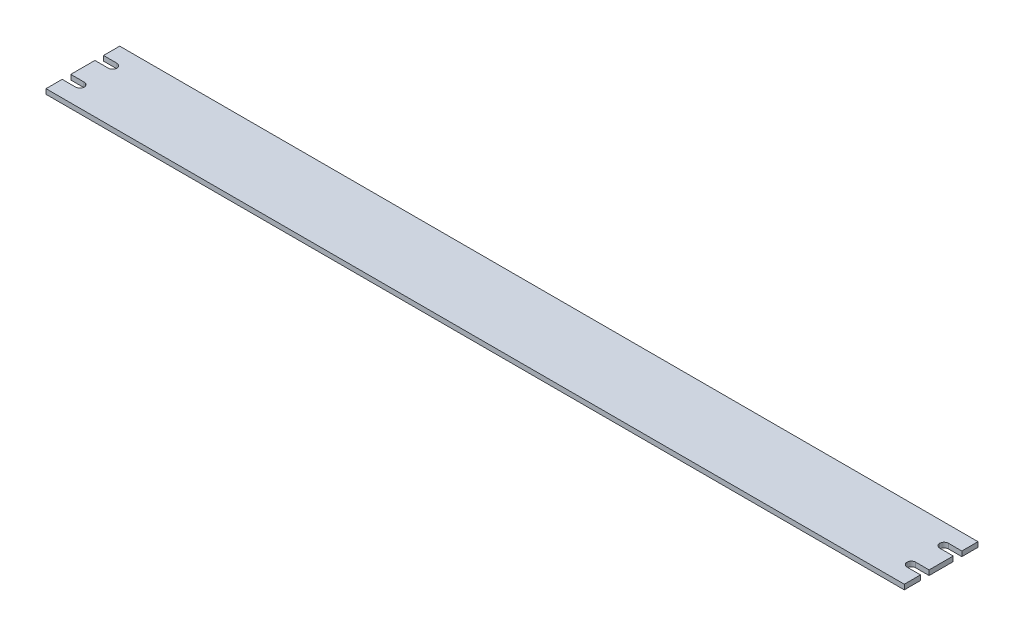
ISO-10303-21;
HEADER;
FILE_DESCRIPTION(('STEP AP214'),'2;1');
FILE_NAME('part.step','',(''),(''),'','','');
FILE_SCHEMA(('AUTOMOTIVE_DESIGN { 1 0 10303 214 1 1 1 1 }'));
ENDSEC;
DATA;
#1=APPLICATION_CONTEXT('core data for automotive mechanical design processes');
#2=APPLICATION_PROTOCOL_DEFINITION('international standard','automotive_design',2000,#1);
#3=PRODUCT_CONTEXT('',#1,'mechanical');
#4=PRODUCT('Part','Part','',(#3));
#5=PRODUCT_RELATED_PRODUCT_CATEGORY('part','',(#4));
#6=PRODUCT_DEFINITION_FORMATION('','',#4);
#7=PRODUCT_DEFINITION_CONTEXT('part definition',#1,'design');
#8=PRODUCT_DEFINITION('design','',#6,#7);
#9=PRODUCT_DEFINITION_SHAPE('','',#8);
#10=(LENGTH_UNIT() NAMED_UNIT(*) SI_UNIT(.MILLI.,.METRE.));
#11=(NAMED_UNIT(*) PLANE_ANGLE_UNIT() SI_UNIT($,.RADIAN.));
#12=(NAMED_UNIT(*) SI_UNIT($,.STERADIAN.) SOLID_ANGLE_UNIT());
#13=UNCERTAINTY_MEASURE_WITH_UNIT(LENGTH_MEASURE(1.E-05),#10,'distance_accuracy_value','');
#14=(GEOMETRIC_REPRESENTATION_CONTEXT(3) GLOBAL_UNCERTAINTY_ASSIGNED_CONTEXT((#13)) GLOBAL_UNIT_ASSIGNED_CONTEXT((#10,
#11,#12)) REPRESENTATION_CONTEXT('',''));
#15=CARTESIAN_POINT('',(0.,0.,0.));
#16=DIRECTION('',(0.,0.,1.));
#17=DIRECTION('',(1.,0.,0.));
#18=AXIS2_PLACEMENT_3D('',#15,#16,#17);
#19=CARTESIAN_POINT('',(259.958004898396,3.44975085150872,-13.0074388865547));
#20=DIRECTION('',(-1.,0.,0.));
#21=DIRECTION('',(0.,0.,1.));
#22=AXIS2_PLACEMENT_3D('',#19,#20,#21);
#23=PLANE('',#22);
#24=DIRECTION('',(0.,0.,-1.));
#25=VECTOR('',#24,1.);
#26=CARTESIAN_POINT('',(259.958004898396,0.449750851508725,-13.0074388865547));
#27=LINE('',#26,#25);
#28=CARTESIAN_POINT('',(259.958004898396,0.449750851508725,-13.0074388865547));
#29=VERTEX_POINT('',#28);
#30=CARTESIAN_POINT('',(259.958004898396,0.449750851508725,-22.8574388865547));
#31=VERTEX_POINT('',#30);
#32=EDGE_CURVE('E200',#29,#31,#27,.T.);
#33=ORIENTED_EDGE('',*,*,#32,.T.);
#34=DIRECTION('',(0.,-1.,0.));
#35=VECTOR('',#34,1.);
#36=CARTESIAN_POINT('',(259.958004898396,3.44975085150872,-22.8574388865547));
#37=LINE('',#36,#35);
#38=CARTESIAN_POINT('',(259.958004898396,3.44975085150872,-22.8574388865547));
#39=VERTEX_POINT('',#38);
#40=EDGE_CURVE('E182',#39,#31,#37,.T.);
#41=ORIENTED_EDGE('',*,*,#40,.F.);
#42=DIRECTION('',(0.,0.,-1.));
#43=VECTOR('',#42,1.);
#44=CARTESIAN_POINT('',(259.958004898396,3.44975085150872,-13.0074388865547));
#45=LINE('',#44,#43);
#46=CARTESIAN_POINT('',(259.958004898396,3.44975085150872,-13.0074388865547));
#47=VERTEX_POINT('',#46);
#48=EDGE_CURVE('E188',#47,#39,#45,.T.);
#49=ORIENTED_EDGE('',*,*,#48,.F.);
#50=DIRECTION('',(0.,-1.,0.));
#51=VECTOR('',#50,1.);
#52=CARTESIAN_POINT('',(259.958004898396,3.44975085150872,-13.0074388865547));
#53=LINE('',#52,#51);
#54=EDGE_CURVE('E313',#47,#29,#53,.T.);
#55=ORIENTED_EDGE('',*,*,#54,.T.);
#56=EDGE_LOOP('',(#33,#41,#49,#55));
#57=FACE_BOUND('',#56,.T.);
#58=ADVANCED_FACE('F16',(#57),#23,.F.);
#59=CARTESIAN_POINT('',(-263.041995101604,3.44975085150872,-22.8574388865547));
#60=DIRECTION('',(0.,0.,1.));
#61=DIRECTION('',(1.,0.,0.));
#62=AXIS2_PLACEMENT_3D('',#59,#60,#61);
#63=PLANE('',#62);
#64=DIRECTION('',(-1.,0.,0.));
#65=VECTOR('',#64,1.);
#66=CARTESIAN_POINT('',(-263.041995101604,0.449750851508725,-22.8574388865547));
#67=LINE('',#66,#65);
#68=CARTESIAN_POINT('',(-263.041995101604,0.449750851508725,-22.8574388865547));
#69=VERTEX_POINT('',#68);
#70=EDGE_CURVE('E286',#31,#69,#67,.T.);
#71=ORIENTED_EDGE('',*,*,#70,.T.);
#72=DIRECTION('',(0.,-1.,0.));
#73=VECTOR('',#72,1.);
#74=CARTESIAN_POINT('',(-263.041995101604,3.44975085150872,-22.8574388865547));
#75=LINE('',#74,#73);
#76=CARTESIAN_POINT('',(-263.041995101604,3.44975085150872,-22.8574388865547));
#77=VERTEX_POINT('',#76);
#78=EDGE_CURVE('E185',#77,#69,#75,.T.);
#79=ORIENTED_EDGE('',*,*,#78,.F.);
#80=DIRECTION('',(-1.,0.,0.));
#81=VECTOR('',#80,1.);
#82=CARTESIAN_POINT('',(-263.041995101604,3.44975085150872,-22.8574388865547));
#83=LINE('',#82,#81);
#84=EDGE_CURVE('E178',#39,#77,#83,.T.);
#85=ORIENTED_EDGE('',*,*,#84,.F.);
#86=ORIENTED_EDGE('',*,*,#40,.T.);
#87=EDGE_LOOP('',(#71,#79,#85,#86));
#88=FACE_BOUND('',#87,.T.);
#89=ADVANCED_FACE('F180',(#88),#63,.F.);
#90=CARTESIAN_POINT('',(-263.041995101604,3.44975085150872,-13.0074388865547));
#91=DIRECTION('',(1.,0.,0.));
#92=DIRECTION('',(0.,0.,-1.));
#93=AXIS2_PLACEMENT_3D('',#90,#91,#92);
#94=PLANE('',#93);
#95=DIRECTION('',(0.,0.,1.));
#96=VECTOR('',#95,1.);
#97=CARTESIAN_POINT('',(-263.041995101604,0.449750851508725,-13.0074388865547));
#98=LINE('',#97,#96);
#99=CARTESIAN_POINT('',(-263.041995101604,0.449750851508725,-13.0074388865547));
#100=VERTEX_POINT('',#99);
#101=EDGE_CURVE('E282',#69,#100,#98,.T.);
#102=ORIENTED_EDGE('',*,*,#101,.T.);
#103=DIRECTION('',(0.,-1.,0.));
#104=VECTOR('',#103,1.);
#105=CARTESIAN_POINT('',(-263.041995101604,3.44975085150872,-13.0074388865547));
#106=LINE('',#105,#104);
#107=CARTESIAN_POINT('',(-263.041995101604,3.44975085150872,-13.0074388865547));
#108=VERTEX_POINT('',#107);
#109=EDGE_CURVE('E206',#108,#100,#106,.T.);
#110=ORIENTED_EDGE('',*,*,#109,.F.);
#111=DIRECTION('',(0.,0.,1.));
#112=VECTOR('',#111,1.);
#113=CARTESIAN_POINT('',(-263.041995101604,3.44975085150872,-13.0074388865547));
#114=LINE('',#113,#112);
#115=EDGE_CURVE('E187',#77,#108,#114,.T.);
#116=ORIENTED_EDGE('',*,*,#115,.F.);
#117=ORIENTED_EDGE('',*,*,#78,.T.);
#118=EDGE_LOOP('',(#102,#110,#116,#117));
#119=FACE_BOUND('',#118,.T.);
#120=ADVANCED_FACE('F384',(#119),#94,.F.);
#121=CARTESIAN_POINT('',(-263.041995101604,3.44975085150872,-13.0074388865547));
#122=DIRECTION('',(0.,0.,-1.));
#123=DIRECTION('',(-1.,0.,0.));
#124=AXIS2_PLACEMENT_3D('',#121,#122,#123);
#125=PLANE('',#124);
#126=DIRECTION('',(1.,0.,0.));
#127=VECTOR('',#126,1.);
#128=CARTESIAN_POINT('',(-263.041995101604,0.449750851508725,-13.0074388865547));
#129=LINE('',#128,#127);
#130=CARTESIAN_POINT('',(-254.891995101604,0.449750851508725,-13.0074388865547));
#131=VERTEX_POINT('',#130);
#132=EDGE_CURVE('E275',#100,#131,#129,.T.);
#133=ORIENTED_EDGE('',*,*,#132,.T.);
#134=DIRECTION('',(0.,-1.,0.));
#135=VECTOR('',#134,1.);
#136=CARTESIAN_POINT('',(-254.891995101604,3.44975085150872,-13.0074388865547));
#137=LINE('',#136,#135);
#138=CARTESIAN_POINT('',(-254.891995101604,3.44975085150872,-13.0074388865547));
#139=VERTEX_POINT('',#138);
#140=EDGE_CURVE('E224',#131,#139,#137,.F.);
#141=ORIENTED_EDGE('',*,*,#140,.T.);
#142=DIRECTION('',(1.,0.,0.));
#143=VECTOR('',#142,1.);
#144=CARTESIAN_POINT('',(-263.041995101604,3.44975085150872,-13.0074388865547));
#145=LINE('',#144,#143);
#146=EDGE_CURVE('E385',#108,#139,#145,.T.);
#147=ORIENTED_EDGE('',*,*,#146,.F.);
#148=ORIENTED_EDGE('',*,*,#109,.T.);
#149=EDGE_LOOP('',(#133,#141,#147,#148));
#150=FACE_BOUND('',#149,.T.);
#151=ADVANCED_FACE('F278',(#150),#125,.F.);
#152=CARTESIAN_POINT('',(-263.041995101604,3.44975085150872,-7.75743888655468));
#153=DIRECTION('',(0.,0.,1.));
#154=DIRECTION('',(1.,0.,0.));
#155=AXIS2_PLACEMENT_3D('',#152,#153,#154);
#156=PLANE('',#155);
#157=DIRECTION('',(-1.,0.,0.));
#158=VECTOR('',#157,1.);
#159=CARTESIAN_POINT('',(-263.041995101604,3.44975085150872,-7.75743888655468));
#160=LINE('',#159,#158);
#161=CARTESIAN_POINT('',(-254.891995101604,3.44975085150872,-7.75743888655467));
#162=VERTEX_POINT('',#161);
#163=CARTESIAN_POINT('',(-263.041995101604,3.44975085150872,-7.75743888655468));
#164=VERTEX_POINT('',#163);
#165=EDGE_CURVE('E363',#162,#164,#160,.T.);
#166=ORIENTED_EDGE('',*,*,#165,.F.);
#167=DIRECTION('',(0.,-1.,0.));
#168=VECTOR('',#167,1.);
#169=CARTESIAN_POINT('',(-254.891995101604,0.449750851508725,-7.75743888655467));
#170=LINE('',#169,#168);
#171=CARTESIAN_POINT('',(-254.891995101604,0.449750851508725,-7.75743888655467));
#172=VERTEX_POINT('',#171);
#173=EDGE_CURVE('E221',#162,#172,#170,.T.);
#174=ORIENTED_EDGE('',*,*,#173,.T.);
#175=DIRECTION('',(-1.,0.,0.));
#176=VECTOR('',#175,1.);
#177=CARTESIAN_POINT('',(-263.041995101604,0.449750851508725,-7.75743888655468));
#178=LINE('',#177,#176);
#179=CARTESIAN_POINT('',(-263.041995101604,0.449750851508725,-7.75743888655468));
#180=VERTEX_POINT('',#179);
#181=EDGE_CURVE('E281',#172,#180,#178,.T.);
#182=ORIENTED_EDGE('',*,*,#181,.T.);
#183=DIRECTION('',(0.,-1.,0.));
#184=VECTOR('',#183,1.);
#185=CARTESIAN_POINT('',(-263.041995101604,3.44975085150872,-7.75743888655468));
#186=LINE('',#185,#184);
#187=EDGE_CURVE('E336',#164,#180,#186,.T.);
#188=ORIENTED_EDGE('',*,*,#187,.F.);
#189=EDGE_LOOP('',(#166,#174,#182,#188));
#190=FACE_BOUND('',#189,.T.);
#191=ADVANCED_FACE('F388',(#190),#156,.F.);
#192=CARTESIAN_POINT('',(-263.041995101604,3.44975085150872,6.94256111344533));
#193=DIRECTION('',(1.,0.,0.));
#194=DIRECTION('',(0.,0.,-1.));
#195=AXIS2_PLACEMENT_3D('',#192,#193,#194);
#196=PLANE('',#195);
#197=DIRECTION('',(0.,0.,1.));
#198=VECTOR('',#197,1.);
#199=CARTESIAN_POINT('',(-263.041995101604,0.449750851508725,6.94256111344533));
#200=LINE('',#199,#198);
#201=CARTESIAN_POINT('',(-263.041995101604,0.449750851508725,6.94256111344533));
#202=VERTEX_POINT('',#201);
#203=EDGE_CURVE('E284',#180,#202,#200,.T.);
#204=ORIENTED_EDGE('',*,*,#203,.T.);
#205=DIRECTION('',(0.,-1.,0.));
#206=VECTOR('',#205,1.);
#207=CARTESIAN_POINT('',(-263.041995101604,3.44975085150872,6.94256111344533));
#208=LINE('',#207,#206);
#209=CARTESIAN_POINT('',(-263.041995101604,3.44975085150872,6.94256111344533));
#210=VERTEX_POINT('',#209);
#211=EDGE_CURVE('E333',#210,#202,#208,.T.);
#212=ORIENTED_EDGE('',*,*,#211,.F.);
#213=DIRECTION('',(0.,0.,1.));
#214=VECTOR('',#213,1.);
#215=CARTESIAN_POINT('',(-263.041995101604,3.44975085150872,6.94256111344533));
#216=LINE('',#215,#214);
#217=EDGE_CURVE('E344',#164,#210,#216,.T.);
#218=ORIENTED_EDGE('',*,*,#217,.F.);
#219=ORIENTED_EDGE('',*,*,#187,.T.);
#220=EDGE_LOOP('',(#204,#212,#218,#219));
#221=FACE_BOUND('',#220,.T.);
#222=ADVANCED_FACE('F342',(#221),#196,.F.);
#223=CARTESIAN_POINT('',(-263.041995101604,3.44975085150872,6.94256111344533));
#224=DIRECTION('',(0.,0.,-1.));
#225=DIRECTION('',(-1.,0.,0.));
#226=AXIS2_PLACEMENT_3D('',#223,#224,#225);
#227=PLANE('',#226);
#228=DIRECTION('',(1.,0.,0.));
#229=VECTOR('',#228,1.);
#230=CARTESIAN_POINT('',(-263.041995101604,0.449750851508725,6.94256111344533));
#231=LINE('',#230,#229);
#232=CARTESIAN_POINT('',(-254.891995101604,0.449750851508725,6.94256111344533));
#233=VERTEX_POINT('',#232);
#234=EDGE_CURVE('E291',#202,#233,#231,.T.);
#235=ORIENTED_EDGE('',*,*,#234,.T.);
#236=DIRECTION('',(0.,-1.,0.));
#237=VECTOR('',#236,1.);
#238=CARTESIAN_POINT('',(-254.891995101604,3.44975085150872,6.94256111344533));
#239=LINE('',#238,#237);
#240=CARTESIAN_POINT('',(-254.891995101604,3.44975085150872,6.94256111344533));
#241=VERTEX_POINT('',#240);
#242=EDGE_CURVE('E219',#233,#241,#239,.F.);
#243=ORIENTED_EDGE('',*,*,#242,.T.);
#244=DIRECTION('',(1.,0.,0.));
#245=VECTOR('',#244,1.);
#246=CARTESIAN_POINT('',(-263.041995101604,3.44975085150872,6.94256111344533));
#247=LINE('',#246,#245);
#248=EDGE_CURVE('E358',#210,#241,#247,.T.);
#249=ORIENTED_EDGE('',*,*,#248,.F.);
#250=ORIENTED_EDGE('',*,*,#211,.T.);
#251=EDGE_LOOP('',(#235,#243,#249,#250));
#252=FACE_BOUND('',#251,.T.);
#253=ADVANCED_FACE('F351',(#252),#227,.F.);
#254=CARTESIAN_POINT('',(-263.041995101604,3.44975085150872,12.1925611134453));
#255=DIRECTION('',(0.,0.,1.));
#256=DIRECTION('',(1.,0.,0.));
#257=AXIS2_PLACEMENT_3D('',#254,#255,#256);
#258=PLANE('',#257);
#259=DIRECTION('',(-1.,0.,0.));
#260=VECTOR('',#259,1.);
#261=CARTESIAN_POINT('',(-263.041995101604,3.44975085150872,12.1925611134453));
#262=LINE('',#261,#260);
#263=CARTESIAN_POINT('',(-254.891995101604,3.44975085150872,12.1925611134453));
#264=VERTEX_POINT('',#263);
#265=CARTESIAN_POINT('',(-263.041995101604,3.44975085150872,12.1925611134453));
#266=VERTEX_POINT('',#265);
#267=EDGE_CURVE('E359',#264,#266,#262,.T.);
#268=ORIENTED_EDGE('',*,*,#267,.F.);
#269=DIRECTION('',(0.,-1.,0.));
#270=VECTOR('',#269,1.);
#271=CARTESIAN_POINT('',(-254.891995101604,0.449750851508725,12.1925611134453));
#272=LINE('',#271,#270);
#273=CARTESIAN_POINT('',(-254.891995101604,0.449750851508725,12.1925611134453));
#274=VERTEX_POINT('',#273);
#275=EDGE_CURVE('E216',#264,#274,#272,.T.);
#276=ORIENTED_EDGE('',*,*,#275,.T.);
#277=DIRECTION('',(-1.,0.,0.));
#278=VECTOR('',#277,1.);
#279=CARTESIAN_POINT('',(-263.041995101604,0.449750851508725,12.1925611134453));
#280=LINE('',#279,#278);
#281=CARTESIAN_POINT('',(-263.041995101604,0.449750851508725,12.1925611134453));
#282=VERTEX_POINT('',#281);
#283=EDGE_CURVE('E294',#274,#282,#280,.T.);
#284=ORIENTED_EDGE('',*,*,#283,.T.);
#285=DIRECTION('',(0.,-1.,0.));
#286=VECTOR('',#285,1.);
#287=CARTESIAN_POINT('',(-263.041995101604,3.44975085150872,12.1925611134453));
#288=LINE('',#287,#286);
#289=EDGE_CURVE('E330',#266,#282,#288,.T.);
#290=ORIENTED_EDGE('',*,*,#289,.F.);
#291=EDGE_LOOP('',(#268,#276,#284,#290));
#292=FACE_BOUND('',#291,.T.);
#293=ADVANCED_FACE('F533',(#292),#258,.F.);
#294=CARTESIAN_POINT('',(-263.041995101604,3.44975085150872,22.0425611134453));
#295=DIRECTION('',(1.,0.,0.));
#296=DIRECTION('',(0.,0.,-1.));
#297=AXIS2_PLACEMENT_3D('',#294,#295,#296);
#298=PLANE('',#297);
#299=DIRECTION('',(0.,0.,1.));
#300=VECTOR('',#299,1.);
#301=CARTESIAN_POINT('',(-263.041995101604,0.449750851508725,22.0425611134453));
#302=LINE('',#301,#300);
#303=CARTESIAN_POINT('',(-263.041995101604,0.449750851508725,22.0425611134453));
#304=VERTEX_POINT('',#303);
#305=EDGE_CURVE('E296',#282,#304,#302,.T.);
#306=ORIENTED_EDGE('',*,*,#305,.T.);
#307=DIRECTION('',(0.,-1.,0.));
#308=VECTOR('',#307,1.);
#309=CARTESIAN_POINT('',(-263.041995101604,3.44975085150872,22.0425611134453));
#310=LINE('',#309,#308);
#311=CARTESIAN_POINT('',(-263.041995101604,3.44975085150872,22.0425611134453));
#312=VERTEX_POINT('',#311);
#313=EDGE_CURVE('E327',#312,#304,#310,.T.);
#314=ORIENTED_EDGE('',*,*,#313,.F.);
#315=DIRECTION('',(0.,0.,1.));
#316=VECTOR('',#315,1.);
#317=CARTESIAN_POINT('',(-263.041995101604,3.44975085150872,22.0425611134453));
#318=LINE('',#317,#316);
#319=EDGE_CURVE('E361',#266,#312,#318,.T.);
#320=ORIENTED_EDGE('',*,*,#319,.F.);
#321=ORIENTED_EDGE('',*,*,#289,.T.);
#322=EDGE_LOOP('',(#306,#314,#320,#321));
#323=FACE_BOUND('',#322,.T.);
#324=ADVANCED_FACE('F525',(#323),#298,.F.);
#325=CARTESIAN_POINT('',(-263.041995101604,3.44975085150872,22.0425611134453));
#326=DIRECTION('',(0.,0.,-1.));
#327=DIRECTION('',(-1.,0.,0.));
#328=AXIS2_PLACEMENT_3D('',#325,#326,#327);
#329=PLANE('',#328);
#330=DIRECTION('',(1.,0.,0.));
#331=VECTOR('',#330,1.);
#332=CARTESIAN_POINT('',(-263.041995101604,0.449750851508725,22.0425611134453));
#333=LINE('',#332,#331);
#334=CARTESIAN_POINT('',(259.958004898396,0.449750851508725,22.0425611134453));
#335=VERTEX_POINT('',#334);
#336=EDGE_CURVE('E298',#304,#335,#333,.T.);
#337=ORIENTED_EDGE('',*,*,#336,.T.);
#338=DIRECTION('',(0.,-1.,0.));
#339=VECTOR('',#338,1.);
#340=CARTESIAN_POINT('',(259.958004898396,3.44975085150872,22.0425611134453));
#341=LINE('',#340,#339);
#342=CARTESIAN_POINT('',(259.958004898396,3.44975085150872,22.0425611134453));
#343=VERTEX_POINT('',#342);
#344=EDGE_CURVE('E324',#343,#335,#341,.T.);
#345=ORIENTED_EDGE('',*,*,#344,.F.);
#346=DIRECTION('',(1.,0.,0.));
#347=VECTOR('',#346,1.);
#348=CARTESIAN_POINT('',(-263.041995101604,3.44975085150872,22.0425611134453));
#349=LINE('',#348,#347);
#350=EDGE_CURVE('E368',#312,#343,#349,.T.);
#351=ORIENTED_EDGE('',*,*,#350,.F.);
#352=ORIENTED_EDGE('',*,*,#313,.T.);
#353=EDGE_LOOP('',(#337,#345,#351,#352));
#354=FACE_BOUND('',#353,.T.);
#355=ADVANCED_FACE('F517',(#354),#329,.F.);
#356=CARTESIAN_POINT('',(259.958004898396,3.44975085150872,22.0425611134453));
#357=DIRECTION('',(-1.,0.,0.));
#358=DIRECTION('',(0.,0.,1.));
#359=AXIS2_PLACEMENT_3D('',#356,#357,#358);
#360=PLANE('',#359);
#361=DIRECTION('',(0.,0.,-1.));
#362=VECTOR('',#361,1.);
#363=CARTESIAN_POINT('',(259.958004898396,0.449750851508725,22.0425611134453));
#364=LINE('',#363,#362);
#365=CARTESIAN_POINT('',(259.958004898396,0.449750851508725,12.1925611134453));
#366=VERTEX_POINT('',#365);
#367=EDGE_CURVE('E300',#335,#366,#364,.T.);
#368=ORIENTED_EDGE('',*,*,#367,.T.);
#369=DIRECTION('',(0.,-1.,0.));
#370=VECTOR('',#369,1.);
#371=CARTESIAN_POINT('',(259.958004898396,3.44975085150872,12.1925611134453));
#372=LINE('',#371,#370);
#373=CARTESIAN_POINT('',(259.958004898396,3.44975085150872,12.1925611134453));
#374=VERTEX_POINT('',#373);
#375=EDGE_CURVE('E321',#374,#366,#372,.T.);
#376=ORIENTED_EDGE('',*,*,#375,.F.);
#377=DIRECTION('',(0.,0.,-1.));
#378=VECTOR('',#377,1.);
#379=CARTESIAN_POINT('',(259.958004898396,3.44975085150872,22.0425611134453));
#380=LINE('',#379,#378);
#381=EDGE_CURVE('E370',#343,#374,#380,.T.);
#382=ORIENTED_EDGE('',*,*,#381,.F.);
#383=ORIENTED_EDGE('',*,*,#344,.T.);
#384=EDGE_LOOP('',(#368,#376,#382,#383));
#385=FACE_BOUND('',#384,.T.);
#386=ADVANCED_FACE('F509',(#385),#360,.F.);
#387=CARTESIAN_POINT('',(259.958004898396,3.44975085150872,12.1925611134453));
#388=DIRECTION('',(0.,0.,1.));
#389=DIRECTION('',(1.,0.,0.));
#390=AXIS2_PLACEMENT_3D('',#387,#388,#389);
#391=PLANE('',#390);
#392=DIRECTION('',(-1.,0.,0.));
#393=VECTOR('',#392,1.);
#394=CARTESIAN_POINT('',(259.958004898396,0.449750851508725,12.1925611134453));
#395=LINE('',#394,#393);
#396=CARTESIAN_POINT('',(251.808004898396,0.449750851508725,12.1925611134453));
#397=VERTEX_POINT('',#396);
#398=EDGE_CURVE('E302',#366,#397,#395,.T.);
#399=ORIENTED_EDGE('',*,*,#398,.T.);
#400=DIRECTION('',(0.,-1.,0.));
#401=VECTOR('',#400,1.);
#402=CARTESIAN_POINT('',(251.808004898396,3.44975085150872,12.1925611134453));
#403=LINE('',#402,#401);
#404=CARTESIAN_POINT('',(251.808004898396,3.44975085150872,12.1925611134453));
#405=VERTEX_POINT('',#404);
#406=EDGE_CURVE('E201',#397,#405,#403,.F.);
#407=ORIENTED_EDGE('',*,*,#406,.T.);
#408=DIRECTION('',(-1.,0.,0.));
#409=VECTOR('',#408,1.);
#410=CARTESIAN_POINT('',(259.958004898396,3.44975085150872,12.1925611134453));
#411=LINE('',#410,#409);
#412=EDGE_CURVE('E372',#374,#405,#411,.T.);
#413=ORIENTED_EDGE('',*,*,#412,.F.);
#414=ORIENTED_EDGE('',*,*,#375,.T.);
#415=EDGE_LOOP('',(#399,#407,#413,#414));
#416=FACE_BOUND('',#415,.T.);
#417=ADVANCED_FACE('F501',(#416),#391,.F.);
#418=CARTESIAN_POINT('',(259.958004898396,3.44975085150872,6.94256111344527));
#419=DIRECTION('',(0.,0.,-1.));
#420=DIRECTION('',(-1.,0.,0.));
#421=AXIS2_PLACEMENT_3D('',#418,#419,#420);
#422=PLANE('',#421);
#423=DIRECTION('',(1.,0.,0.));
#424=VECTOR('',#423,1.);
#425=CARTESIAN_POINT('',(259.958004898396,3.44975085150872,6.94256111344527));
#426=LINE('',#425,#424);
#427=CARTESIAN_POINT('',(251.808004898396,3.44975085150872,6.94256111344527));
#428=VERTEX_POINT('',#427);
#429=CARTESIAN_POINT('',(259.958004898396,3.44975085150872,6.94256111344527));
#430=VERTEX_POINT('',#429);
#431=EDGE_CURVE('E375',#428,#430,#426,.T.);
#432=ORIENTED_EDGE('',*,*,#431,.F.);
#433=DIRECTION('',(0.,-1.,0.));
#434=VECTOR('',#433,1.);
#435=CARTESIAN_POINT('',(251.808004898396,0.449750851508725,6.94256111344527));
#436=LINE('',#435,#434);
#437=CARTESIAN_POINT('',(251.808004898396,0.449750851508725,6.94256111344527));
#438=VERTEX_POINT('',#437);
#439=EDGE_CURVE('E204',#428,#438,#436,.T.);
#440=ORIENTED_EDGE('',*,*,#439,.T.);
#441=DIRECTION('',(1.,0.,0.));
#442=VECTOR('',#441,1.);
#443=CARTESIAN_POINT('',(259.958004898396,0.449750851508725,6.94256111344527));
#444=LINE('',#443,#442);
#445=CARTESIAN_POINT('',(259.958004898396,0.449750851508725,6.94256111344527));
#446=VERTEX_POINT('',#445);
#447=EDGE_CURVE('E305',#438,#446,#444,.T.);
#448=ORIENTED_EDGE('',*,*,#447,.T.);
#449=DIRECTION('',(0.,-1.,0.));
#450=VECTOR('',#449,1.);
#451=CARTESIAN_POINT('',(259.958004898396,3.44975085150872,6.94256111344527));
#452=LINE('',#451,#450);
#453=EDGE_CURVE('E318',#430,#446,#452,.T.);
#454=ORIENTED_EDGE('',*,*,#453,.F.);
#455=EDGE_LOOP('',(#432,#440,#448,#454));
#456=FACE_BOUND('',#455,.T.);
#457=ADVANCED_FACE('F493',(#456),#422,.F.);
#458=CARTESIAN_POINT('',(259.958004898396,3.44975085150872,6.94256111344527));
#459=DIRECTION('',(-1.,0.,0.));
#460=DIRECTION('',(0.,0.,1.));
#461=AXIS2_PLACEMENT_3D('',#458,#459,#460);
#462=PLANE('',#461);
#463=DIRECTION('',(0.,0.,-1.));
#464=VECTOR('',#463,1.);
#465=CARTESIAN_POINT('',(259.958004898396,0.449750851508725,6.94256111344527));
#466=LINE('',#465,#464);
#467=CARTESIAN_POINT('',(259.958004898396,0.449750851508725,-7.75743888655474));
#468=VERTEX_POINT('',#467);
#469=EDGE_CURVE('E307',#446,#468,#466,.T.);
#470=ORIENTED_EDGE('',*,*,#469,.T.);
#471=DIRECTION('',(0.,-1.,0.));
#472=VECTOR('',#471,1.);
#473=CARTESIAN_POINT('',(259.958004898396,3.44975085150872,-7.75743888655474));
#474=LINE('',#473,#472);
#475=CARTESIAN_POINT('',(259.958004898396,3.44975085150872,-7.75743888655474));
#476=VERTEX_POINT('',#475);
#477=EDGE_CURVE('E315',#476,#468,#474,.T.);
#478=ORIENTED_EDGE('',*,*,#477,.F.);
#479=DIRECTION('',(0.,0.,-1.));
#480=VECTOR('',#479,1.);
#481=CARTESIAN_POINT('',(259.958004898396,3.44975085150872,6.94256111344527));
#482=LINE('',#481,#480);
#483=EDGE_CURVE('E377',#430,#476,#482,.T.);
#484=ORIENTED_EDGE('',*,*,#483,.F.);
#485=ORIENTED_EDGE('',*,*,#453,.T.);
#486=EDGE_LOOP('',(#470,#478,#484,#485));
#487=FACE_BOUND('',#486,.T.);
#488=ADVANCED_FACE('F485',(#487),#462,.F.);
#489=CARTESIAN_POINT('',(259.958004898396,3.44975085150872,-7.75743888655474));
#490=DIRECTION('',(0.,0.,1.));
#491=DIRECTION('',(1.,0.,0.));
#492=AXIS2_PLACEMENT_3D('',#489,#490,#491);
#493=PLANE('',#492);
#494=DIRECTION('',(-1.,0.,0.));
#495=VECTOR('',#494,1.);
#496=CARTESIAN_POINT('',(259.958004898396,0.449750851508725,-7.75743888655474));
#497=LINE('',#496,#495);
#498=CARTESIAN_POINT('',(251.808004898396,0.449750851508725,-7.75743888655474));
#499=VERTEX_POINT('',#498);
#500=EDGE_CURVE('E309',#468,#499,#497,.T.);
#501=ORIENTED_EDGE('',*,*,#500,.T.);
#502=DIRECTION('',(0.,-1.,0.));
#503=VECTOR('',#502,1.);
#504=CARTESIAN_POINT('',(251.808004898396,3.44975085150872,-7.75743888655474));
#505=LINE('',#504,#503);
#506=CARTESIAN_POINT('',(251.808004898396,3.44975085150872,-7.75743888655474));
#507=VERTEX_POINT('',#506);
#508=EDGE_CURVE('E211',#499,#507,#505,.F.);
#509=ORIENTED_EDGE('',*,*,#508,.T.);
#510=DIRECTION('',(-1.,0.,0.));
#511=VECTOR('',#510,1.);
#512=CARTESIAN_POINT('',(259.958004898396,3.44975085150872,-7.75743888655474));
#513=LINE('',#512,#511);
#514=EDGE_CURVE('E379',#476,#507,#513,.T.);
#515=ORIENTED_EDGE('',*,*,#514,.F.);
#516=ORIENTED_EDGE('',*,*,#477,.T.);
#517=EDGE_LOOP('',(#501,#509,#515,#516));
#518=FACE_BOUND('',#517,.T.);
#519=ADVANCED_FACE('F477',(#518),#493,.F.);
#520=CARTESIAN_POINT('',(259.958004898396,3.44975085150872,-13.0074388865547));
#521=DIRECTION('',(0.,0.,-1.));
#522=DIRECTION('',(-1.,0.,0.));
#523=AXIS2_PLACEMENT_3D('',#520,#521,#522);
#524=PLANE('',#523);
#525=DIRECTION('',(1.,0.,0.));
#526=VECTOR('',#525,1.);
#527=CARTESIAN_POINT('',(259.958004898396,3.44975085150872,-13.0074388865547));
#528=LINE('',#527,#526);
#529=CARTESIAN_POINT('',(251.808004898396,3.44975085150872,-13.0074388865547));
#530=VERTEX_POINT('',#529);
#531=EDGE_CURVE('E193',#530,#47,#528,.T.);
#532=ORIENTED_EDGE('',*,*,#531,.F.);
#533=DIRECTION('',(0.,-1.,0.));
#534=VECTOR('',#533,1.);
#535=CARTESIAN_POINT('',(251.808004898396,0.449750851508725,-13.0074388865547));
#536=LINE('',#535,#534);
#537=CARTESIAN_POINT('',(251.808004898396,0.449750851508725,-13.0074388865547));
#538=VERTEX_POINT('',#537);
#539=EDGE_CURVE('E214',#530,#538,#536,.T.);
#540=ORIENTED_EDGE('',*,*,#539,.T.);
#541=DIRECTION('',(1.,0.,0.));
#542=VECTOR('',#541,1.);
#543=CARTESIAN_POINT('',(259.958004898396,0.449750851508725,-13.0074388865547));
#544=LINE('',#543,#542);
#545=EDGE_CURVE('E197',#538,#29,#544,.T.);
#546=ORIENTED_EDGE('',*,*,#545,.T.);
#547=ORIENTED_EDGE('',*,*,#54,.F.);
#548=EDGE_LOOP('',(#532,#540,#546,#547));
#549=FACE_BOUND('',#548,.T.);
#550=ADVANCED_FACE('F470',(#549),#524,.F.);
#551=CARTESIAN_POINT('',(-1.54199510160424,3.44975085150872,-0.407438886554701));
#552=DIRECTION('',(0.,-1.,0.));
#553=DIRECTION('',(0.,0.,-1.));
#554=AXIS2_PLACEMENT_3D('',#551,#552,#553);
#555=PLANE('',#554);
#556=ORIENTED_EDGE('',*,*,#48,.T.);
#557=ORIENTED_EDGE('',*,*,#84,.T.);
#558=ORIENTED_EDGE('',*,*,#115,.T.);
#559=ORIENTED_EDGE('',*,*,#146,.T.);
#560=CARTESIAN_POINT('',(-254.891995101604,3.44975085150872,-10.3074388865547));
#561=DIRECTION('',(0.,-1.,0.));
#562=DIRECTION('',(0.,0.,-1.));
#563=AXIS2_PLACEMENT_3D('',#560,#561,#562);
#564=CIRCLE('',#563,2.7);
#565=CARTESIAN_POINT('',(-252.193036969287,3.44975085150872,-10.3824388865547));
#566=VERTEX_POINT('',#565);
#567=EDGE_CURVE('E10',#139,#566,#564,.T.);
#568=ORIENTED_EDGE('',*,*,#567,.T.);
#569=CARTESIAN_POINT('',(-254.891995101604,3.44975085150872,-10.4574388865547));
#570=DIRECTION('',(0.,-1.,0.));
#571=DIRECTION('',(0.,0.,-1.));
#572=AXIS2_PLACEMENT_3D('',#569,#570,#571);
#573=CIRCLE('',#572,2.7);
#574=EDGE_CURVE('E251',#566,#162,#573,.T.);
#575=ORIENTED_EDGE('',*,*,#574,.T.);
#576=ORIENTED_EDGE('',*,*,#165,.T.);
#577=ORIENTED_EDGE('',*,*,#217,.T.);
#578=ORIENTED_EDGE('',*,*,#248,.T.);
#579=CARTESIAN_POINT('',(-254.891995101604,3.44975085150872,9.64256111344533));
#580=DIRECTION('',(0.,-1.,0.));
#581=DIRECTION('',(0.,0.,-1.));
#582=AXIS2_PLACEMENT_3D('',#579,#580,#581);
#583=CIRCLE('',#582,2.7);
#584=CARTESIAN_POINT('',(-252.193036969287,3.44975085150872,9.56756111344533));
#585=VERTEX_POINT('',#584);
#586=EDGE_CURVE('E248',#241,#585,#583,.T.);
#587=ORIENTED_EDGE('',*,*,#586,.T.);
#588=CARTESIAN_POINT('',(-254.891995101604,3.44975085150872,9.49256111344533));
#589=DIRECTION('',(0.,-1.,0.));
#590=DIRECTION('',(0.,0.,-1.));
#591=AXIS2_PLACEMENT_3D('',#588,#589,#590);
#592=CIRCLE('',#591,2.7);
#593=EDGE_CURVE('E244',#585,#264,#592,.T.);
#594=ORIENTED_EDGE('',*,*,#593,.T.);
#595=ORIENTED_EDGE('',*,*,#267,.T.);
#596=ORIENTED_EDGE('',*,*,#319,.T.);
#597=ORIENTED_EDGE('',*,*,#350,.T.);
#598=ORIENTED_EDGE('',*,*,#381,.T.);
#599=ORIENTED_EDGE('',*,*,#412,.T.);
#600=CARTESIAN_POINT('',(251.808004898396,3.44975085150872,9.49256111344527));
#601=DIRECTION('',(0.,-1.,0.));
#602=DIRECTION('',(0.,0.,-1.));
#603=AXIS2_PLACEMENT_3D('',#600,#601,#602);
#604=CIRCLE('',#603,2.7);
#605=CARTESIAN_POINT('',(249.109046766079,3.44975085150872,9.56756111344527));
#606=VERTEX_POINT('',#605);
#607=EDGE_CURVE('E228',#405,#606,#604,.T.);
#608=ORIENTED_EDGE('',*,*,#607,.T.);
#609=CARTESIAN_POINT('',(251.808004898396,3.44975085150872,9.64256111344527));
#610=DIRECTION('',(0.,-1.,0.));
#611=DIRECTION('',(0.,0.,-1.));
#612=AXIS2_PLACEMENT_3D('',#609,#610,#611);
#613=CIRCLE('',#612,2.7);
#614=EDGE_CURVE('E232',#606,#428,#613,.T.);
#615=ORIENTED_EDGE('',*,*,#614,.T.);
#616=ORIENTED_EDGE('',*,*,#431,.T.);
#617=ORIENTED_EDGE('',*,*,#483,.T.);
#618=ORIENTED_EDGE('',*,*,#514,.T.);
#619=CARTESIAN_POINT('',(251.808004898396,3.44975085150872,-10.4574388865547));
#620=DIRECTION('',(0.,-1.,0.));
#621=DIRECTION('',(0.,0.,-1.));
#622=AXIS2_PLACEMENT_3D('',#619,#620,#621);
#623=CIRCLE('',#622,2.7);
#624=CARTESIAN_POINT('',(249.109046766079,3.44975085150872,-10.3824388865547));
#625=VERTEX_POINT('',#624);
#626=EDGE_CURVE('E236',#507,#625,#623,.T.);
#627=ORIENTED_EDGE('',*,*,#626,.T.);
#628=CARTESIAN_POINT('',(251.808004898396,3.44975085150872,-10.3074388865547));
#629=DIRECTION('',(0.,-1.,0.));
#630=DIRECTION('',(0.,0.,-1.));
#631=AXIS2_PLACEMENT_3D('',#628,#629,#630);
#632=CIRCLE('',#631,2.7);
#633=EDGE_CURVE('E240',#625,#530,#632,.T.);
#634=ORIENTED_EDGE('',*,*,#633,.T.);
#635=ORIENTED_EDGE('',*,*,#531,.T.);
#636=EDGE_LOOP('',(#556,#557,#558,#559,#568,#575,#576,#577,#578,#587,#594,#595,#596,#597,#598,
#599,#608,#615,#616,#617,#618,#627,#634,#635));
#637=FACE_BOUND('',#636,.T.);
#638=ADVANCED_FACE('F191',(#637),#555,.F.);
#639=CARTESIAN_POINT('',(-1.54199510160424,0.449750851508725,-0.407438886554701));
#640=DIRECTION('',(0.,-1.,0.));
#641=DIRECTION('',(0.,0.,-1.));
#642=AXIS2_PLACEMENT_3D('',#639,#640,#641);
#643=PLANE('',#642);
#644=ORIENTED_EDGE('',*,*,#32,.F.);
#645=ORIENTED_EDGE('',*,*,#545,.F.);
#646=CARTESIAN_POINT('',(251.808004898396,0.449750851508725,-10.3074388865547));
#647=DIRECTION('',(0.,-1.,0.));
#648=DIRECTION('',(0.,0.,-1.));
#649=AXIS2_PLACEMENT_3D('',#646,#647,#648);
#650=CIRCLE('',#649,2.7);
#651=CARTESIAN_POINT('',(249.109046766079,0.449750851508725,-10.3824388865547));
#652=VERTEX_POINT('',#651);
#653=EDGE_CURVE('E238',#538,#652,#650,.F.);
#654=ORIENTED_EDGE('',*,*,#653,.T.);
#655=CARTESIAN_POINT('',(251.808004898396,0.449750851508725,-10.4574388865547));
#656=DIRECTION('',(0.,-1.,0.));
#657=DIRECTION('',(0.,0.,-1.));
#658=AXIS2_PLACEMENT_3D('',#655,#656,#657);
#659=CIRCLE('',#658,2.7);
#660=EDGE_CURVE('E234',#652,#499,#659,.F.);
#661=ORIENTED_EDGE('',*,*,#660,.T.);
#662=ORIENTED_EDGE('',*,*,#500,.F.);
#663=ORIENTED_EDGE('',*,*,#469,.F.);
#664=ORIENTED_EDGE('',*,*,#447,.F.);
#665=CARTESIAN_POINT('',(251.808004898396,0.449750851508725,9.64256111344527));
#666=DIRECTION('',(0.,-1.,0.));
#667=DIRECTION('',(0.,0.,-1.));
#668=AXIS2_PLACEMENT_3D('',#665,#666,#667);
#669=CIRCLE('',#668,2.7);
#670=CARTESIAN_POINT('',(249.109046766079,0.449750851508725,9.56756111344527));
#671=VERTEX_POINT('',#670);
#672=EDGE_CURVE('E230',#438,#671,#669,.F.);
#673=ORIENTED_EDGE('',*,*,#672,.T.);
#674=CARTESIAN_POINT('',(251.808004898396,0.449750851508725,9.49256111344527));
#675=DIRECTION('',(0.,-1.,0.));
#676=DIRECTION('',(0.,0.,-1.));
#677=AXIS2_PLACEMENT_3D('',#674,#675,#676);
#678=CIRCLE('',#677,2.7);
#679=EDGE_CURVE('E226',#671,#397,#678,.F.);
#680=ORIENTED_EDGE('',*,*,#679,.T.);
#681=ORIENTED_EDGE('',*,*,#398,.F.);
#682=ORIENTED_EDGE('',*,*,#367,.F.);
#683=ORIENTED_EDGE('',*,*,#336,.F.);
#684=ORIENTED_EDGE('',*,*,#305,.F.);
#685=ORIENTED_EDGE('',*,*,#283,.F.);
#686=CARTESIAN_POINT('',(-254.891995101604,0.449750851508725,9.49256111344533));
#687=DIRECTION('',(0.,-1.,0.));
#688=DIRECTION('',(0.,0.,-1.));
#689=AXIS2_PLACEMENT_3D('',#686,#687,#688);
#690=CIRCLE('',#689,2.7);
#691=CARTESIAN_POINT('',(-252.193036969287,0.449750851508725,9.56756111344533));
#692=VERTEX_POINT('',#691);
#693=EDGE_CURVE('E242',#274,#692,#690,.F.);
#694=ORIENTED_EDGE('',*,*,#693,.T.);
#695=CARTESIAN_POINT('',(-254.891995101604,0.449750851508725,9.64256111344533));
#696=DIRECTION('',(0.,-1.,0.));
#697=DIRECTION('',(0.,0.,-1.));
#698=AXIS2_PLACEMENT_3D('',#695,#696,#697);
#699=CIRCLE('',#698,2.7);
#700=EDGE_CURVE('E246',#692,#233,#699,.F.);
#701=ORIENTED_EDGE('',*,*,#700,.T.);
#702=ORIENTED_EDGE('',*,*,#234,.F.);
#703=ORIENTED_EDGE('',*,*,#203,.F.);
#704=ORIENTED_EDGE('',*,*,#181,.F.);
#705=CARTESIAN_POINT('',(-254.891995101604,0.449750851508725,-10.4574388865547));
#706=DIRECTION('',(0.,-1.,0.));
#707=DIRECTION('',(0.,0.,-1.));
#708=AXIS2_PLACEMENT_3D('',#705,#706,#707);
#709=CIRCLE('',#708,2.7);
#710=CARTESIAN_POINT('',(-252.193036969287,0.449750851508725,-10.3824388865547));
#711=VERTEX_POINT('',#710);
#712=EDGE_CURVE('E39',#172,#711,#709,.F.);
#713=ORIENTED_EDGE('',*,*,#712,.T.);
#714=CARTESIAN_POINT('',(-254.891995101604,0.449750851508725,-10.3074388865547));
#715=DIRECTION('',(0.,-1.,0.));
#716=DIRECTION('',(0.,0.,-1.));
#717=AXIS2_PLACEMENT_3D('',#714,#715,#716);
#718=CIRCLE('',#717,2.7);
#719=EDGE_CURVE('E25',#711,#131,#718,.F.);
#720=ORIENTED_EDGE('',*,*,#719,.T.);
#721=ORIENTED_EDGE('',*,*,#132,.F.);
#722=ORIENTED_EDGE('',*,*,#101,.F.);
#723=ORIENTED_EDGE('',*,*,#70,.F.);
#724=EDGE_LOOP('',(#644,#645,#654,#661,#662,#663,#664,#673,#680,#681,#682,#683,#684,#685,#694,
#701,#702,#703,#704,#713,#720,#721,#722,#723));
#725=FACE_BOUND('',#724,.T.);
#726=ADVANCED_FACE('F273',(#725),#643,.T.);
#727=CARTESIAN_POINT('',(251.808004898396,3.44975085150872,9.64256111344527));
#728=DIRECTION('',(0.,1.,0.));
#729=DIRECTION('',(0.,0.,1.));
#730=AXIS2_PLACEMENT_3D('',#727,#728,#729);
#731=CYLINDRICAL_SURFACE('',#730,2.7);
#732=ORIENTED_EDGE('',*,*,#439,.F.);
#733=ORIENTED_EDGE('',*,*,#614,.F.);
#734=DIRECTION('',(0.,1.,0.));
#735=VECTOR('',#734,1.);
#736=CARTESIAN_POINT('',(249.109046766079,1.94975085150872,9.56756111344527));
#737=LINE('',#736,#735);
#738=EDGE_CURVE('E254',#671,#606,#737,.T.);
#739=ORIENTED_EDGE('',*,*,#738,.F.);
#740=ORIENTED_EDGE('',*,*,#672,.F.);
#741=EDGE_LOOP('',(#732,#733,#739,#740));
#742=FACE_BOUND('',#741,.T.);
#743=ADVANCED_FACE('F410',(#742),#731,.F.);
#744=CARTESIAN_POINT('',(251.808004898396,3.44975085150872,9.49256111344527));
#745=DIRECTION('',(0.,1.,0.));
#746=DIRECTION('',(0.,0.,1.));
#747=AXIS2_PLACEMENT_3D('',#744,#745,#746);
#748=CYLINDRICAL_SURFACE('',#747,2.7);
#749=ORIENTED_EDGE('',*,*,#607,.F.);
#750=ORIENTED_EDGE('',*,*,#406,.F.);
#751=ORIENTED_EDGE('',*,*,#679,.F.);
#752=ORIENTED_EDGE('',*,*,#738,.T.);
#753=EDGE_LOOP('',(#749,#750,#751,#752));
#754=FACE_BOUND('',#753,.T.);
#755=ADVANCED_FACE('F406',(#754),#748,.F.);
#756=CARTESIAN_POINT('',(251.808004898396,3.44975085150872,-10.3074388865547));
#757=DIRECTION('',(0.,1.,0.));
#758=DIRECTION('',(0.,0.,1.));
#759=AXIS2_PLACEMENT_3D('',#756,#757,#758);
#760=CYLINDRICAL_SURFACE('',#759,2.7);
#761=ORIENTED_EDGE('',*,*,#539,.F.);
#762=ORIENTED_EDGE('',*,*,#633,.F.);
#763=DIRECTION('',(0.,1.,0.));
#764=VECTOR('',#763,1.);
#765=CARTESIAN_POINT('',(249.109046766079,1.94975085150872,-10.3824388865547));
#766=LINE('',#765,#764);
#767=EDGE_CURVE('E257',#652,#625,#766,.T.);
#768=ORIENTED_EDGE('',*,*,#767,.F.);
#769=ORIENTED_EDGE('',*,*,#653,.F.);
#770=EDGE_LOOP('',(#761,#762,#768,#769));
#771=FACE_BOUND('',#770,.T.);
#772=ADVANCED_FACE('F409',(#771),#760,.F.);
#773=CARTESIAN_POINT('',(251.808004898396,3.44975085150872,-10.4574388865547));
#774=DIRECTION('',(0.,1.,0.));
#775=DIRECTION('',(0.,0.,1.));
#776=AXIS2_PLACEMENT_3D('',#773,#774,#775);
#777=CYLINDRICAL_SURFACE('',#776,2.7);
#778=ORIENTED_EDGE('',*,*,#626,.F.);
#779=ORIENTED_EDGE('',*,*,#508,.F.);
#780=ORIENTED_EDGE('',*,*,#660,.F.);
#781=ORIENTED_EDGE('',*,*,#767,.T.);
#782=EDGE_LOOP('',(#778,#779,#780,#781));
#783=FACE_BOUND('',#782,.T.);
#784=ADVANCED_FACE('F415',(#783),#777,.F.);
#785=CARTESIAN_POINT('',(-254.891995101604,3.44975085150872,9.64256111344533));
#786=DIRECTION('',(0.,1.,0.));
#787=DIRECTION('',(0.,0.,1.));
#788=AXIS2_PLACEMENT_3D('',#785,#786,#787);
#789=CYLINDRICAL_SURFACE('',#788,2.7);
#790=DIRECTION('',(0.,1.,0.));
#791=VECTOR('',#790,1.);
#792=CARTESIAN_POINT('',(-252.193036969287,1.94975085150872,9.56756111344533));
#793=LINE('',#792,#791);
#794=EDGE_CURVE('E259',#585,#692,#793,.F.);
#795=ORIENTED_EDGE('',*,*,#794,.F.);
#796=ORIENTED_EDGE('',*,*,#586,.F.);
#797=ORIENTED_EDGE('',*,*,#242,.F.);
#798=ORIENTED_EDGE('',*,*,#700,.F.);
#799=EDGE_LOOP('',(#795,#796,#797,#798));
#800=FACE_BOUND('',#799,.T.);
#801=ADVANCED_FACE('F356',(#800),#789,.F.);
#802=CARTESIAN_POINT('',(-254.891995101604,3.44975085150872,9.49256111344533));
#803=DIRECTION('',(0.,1.,0.));
#804=DIRECTION('',(0.,0.,1.));
#805=AXIS2_PLACEMENT_3D('',#802,#803,#804);
#806=CYLINDRICAL_SURFACE('',#805,2.7);
#807=ORIENTED_EDGE('',*,*,#593,.F.);
#808=ORIENTED_EDGE('',*,*,#794,.T.);
#809=ORIENTED_EDGE('',*,*,#693,.F.);
#810=ORIENTED_EDGE('',*,*,#275,.F.);
#811=EDGE_LOOP('',(#807,#808,#809,#810));
#812=FACE_BOUND('',#811,.T.);
#813=ADVANCED_FACE('F422',(#812),#806,.F.);
#814=CARTESIAN_POINT('',(-254.891995101604,3.44975085150872,-10.3074388865547));
#815=DIRECTION('',(0.,1.,0.));
#816=DIRECTION('',(0.,0.,1.));
#817=AXIS2_PLACEMENT_3D('',#814,#815,#816);
#818=CYLINDRICAL_SURFACE('',#817,2.7);
#819=DIRECTION('',(0.,1.,0.));
#820=VECTOR('',#819,1.);
#821=CARTESIAN_POINT('',(-252.193036969287,1.94975085150872,-10.3824388865547));
#822=LINE('',#821,#820);
#823=EDGE_CURVE('E20',#566,#711,#822,.F.);
#824=ORIENTED_EDGE('',*,*,#823,.F.);
#825=ORIENTED_EDGE('',*,*,#567,.F.);
#826=ORIENTED_EDGE('',*,*,#140,.F.);
#827=ORIENTED_EDGE('',*,*,#719,.F.);
#828=EDGE_LOOP('',(#824,#825,#826,#827));
#829=FACE_BOUND('',#828,.T.);
#830=ADVANCED_FACE('F18',(#829),#818,.F.);
#831=CARTESIAN_POINT('',(-254.891995101604,3.44975085150872,-10.4574388865547));
#832=DIRECTION('',(0.,1.,0.));
#833=DIRECTION('',(0.,0.,1.));
#834=AXIS2_PLACEMENT_3D('',#831,#832,#833);
#835=CYLINDRICAL_SURFACE('',#834,2.7);
#836=ORIENTED_EDGE('',*,*,#574,.F.);
#837=ORIENTED_EDGE('',*,*,#823,.T.);
#838=ORIENTED_EDGE('',*,*,#712,.F.);
#839=ORIENTED_EDGE('',*,*,#173,.F.);
#840=EDGE_LOOP('',(#836,#837,#838,#839));
#841=FACE_BOUND('',#840,.T.);
#842=ADVANCED_FACE('F267',(#841),#835,.F.);
#843=CLOSED_SHELL('',(#58,#89,#120,#151,#191,#222,#253,#293,#324,#355,#386,#417,#457,#488,#519,
#550,#638,#726,#743,#755,#772,#784,#801,#813,#830,#842));
#844=MANIFOLD_SOLID_BREP('B1',#843);
#845=ADVANCED_BREP_SHAPE_REPRESENTATION('',(#18,#844),#14);
#846=SHAPE_DEFINITION_REPRESENTATION(#9,#845);
ENDSEC;
END-ISO-10303-21;
